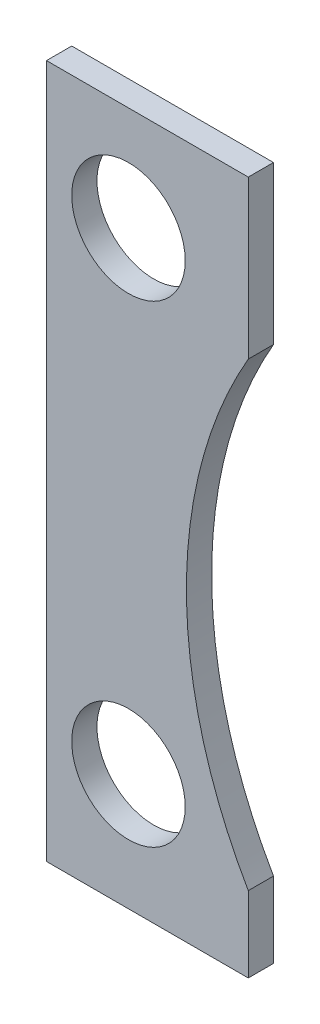
ISO-10303-21;
HEADER;
FILE_DESCRIPTION(('STEP AP214'),'2;1');
FILE_NAME('part.step','',(''),(''),'','','');
FILE_SCHEMA(('AUTOMOTIVE_DESIGN { 1 0 10303 214 1 1 1 1 }'));
ENDSEC;
DATA;
#1=APPLICATION_CONTEXT('core data for automotive mechanical design processes');
#2=APPLICATION_PROTOCOL_DEFINITION('international standard','automotive_design',2000,#1);
#3=PRODUCT_CONTEXT('',#1,'mechanical');
#4=PRODUCT('Part','Part','',(#3));
#5=PRODUCT_RELATED_PRODUCT_CATEGORY('part','',(#4));
#6=PRODUCT_DEFINITION_FORMATION('','',#4);
#7=PRODUCT_DEFINITION_CONTEXT('part definition',#1,'design');
#8=PRODUCT_DEFINITION('design','',#6,#7);
#9=PRODUCT_DEFINITION_SHAPE('','',#8);
#10=(LENGTH_UNIT() NAMED_UNIT(*) SI_UNIT(.MILLI.,.METRE.));
#11=(NAMED_UNIT(*) PLANE_ANGLE_UNIT() SI_UNIT($,.RADIAN.));
#12=(NAMED_UNIT(*) SI_UNIT($,.STERADIAN.) SOLID_ANGLE_UNIT());
#13=UNCERTAINTY_MEASURE_WITH_UNIT(LENGTH_MEASURE(1.E-05),#10,'distance_accuracy_value','');
#14=(GEOMETRIC_REPRESENTATION_CONTEXT(3) GLOBAL_UNCERTAINTY_ASSIGNED_CONTEXT((#13)) GLOBAL_UNIT_ASSIGNED_CONTEXT((#10,
#11,#12)) REPRESENTATION_CONTEXT('',''));
#15=CARTESIAN_POINT('',(0.,0.,0.));
#16=DIRECTION('',(0.,0.,1.));
#17=DIRECTION('',(1.,0.,0.));
#18=AXIS2_PLACEMENT_3D('',#15,#16,#17);
#19=CARTESIAN_POINT('',(0.,0.,2.));
#20=DIRECTION('',(0.,1.,0.));
#21=DIRECTION('',(0.,0.,1.));
#22=AXIS2_PLACEMENT_3D('',#19,#20,#21);
#23=PLANE('',#22);
#24=DIRECTION('',(1.,0.,0.));
#25=VECTOR('',#24,1.);
#26=CARTESIAN_POINT('',(0.,0.,-2.));
#27=LINE('',#26,#25);
#28=CARTESIAN_POINT('',(0.,0.,-2.));
#29=VERTEX_POINT('',#28);
#30=CARTESIAN_POINT('',(32.,0.,-2.));
#31=VERTEX_POINT('',#30);
#32=EDGE_CURVE('E118',#29,#31,#27,.T.);
#33=ORIENTED_EDGE('',*,*,#32,.T.);
#34=DIRECTION('',(0.,0.,-1.));
#35=VECTOR('',#34,1.);
#36=CARTESIAN_POINT('',(32.,0.,2.));
#37=LINE('',#36,#35);
#38=CARTESIAN_POINT('',(32.,0.,2.));
#39=VERTEX_POINT('',#38);
#40=EDGE_CURVE('E11',#39,#31,#37,.T.);
#41=ORIENTED_EDGE('',*,*,#40,.F.);
#42=DIRECTION('',(1.,0.,0.));
#43=VECTOR('',#42,1.);
#44=CARTESIAN_POINT('',(0.,0.,2.));
#45=LINE('',#44,#43);
#46=CARTESIAN_POINT('',(0.,0.,2.));
#47=VERTEX_POINT('',#46);
#48=EDGE_CURVE('E129',#47,#39,#45,.T.);
#49=ORIENTED_EDGE('',*,*,#48,.F.);
#50=DIRECTION('',(0.,0.,-1.));
#51=VECTOR('',#50,1.);
#52=CARTESIAN_POINT('',(0.,0.,2.));
#53=LINE('',#52,#51);
#54=EDGE_CURVE('E114',#47,#29,#53,.T.);
#55=ORIENTED_EDGE('',*,*,#54,.T.);
#56=EDGE_LOOP('',(#33,#41,#49,#55));
#57=FACE_BOUND('',#56,.T.);
#58=ADVANCED_FACE('F34',(#57),#23,.F.);
#59=CARTESIAN_POINT('',(32.,0.,2.));
#60=DIRECTION('',(-1.,0.,0.));
#61=DIRECTION('',(0.,-1.,0.));
#62=AXIS2_PLACEMENT_3D('',#59,#60,#61);
#63=PLANE('',#62);
#64=DIRECTION('',(0.,1.,0.));
#65=VECTOR('',#64,1.);
#66=CARTESIAN_POINT('',(32.,0.,-2.));
#67=LINE('',#66,#65);
#68=CARTESIAN_POINT('',(32.,12.,-2.));
#69=VERTEX_POINT('',#68);
#70=EDGE_CURVE('E121',#31,#69,#67,.T.);
#71=ORIENTED_EDGE('',*,*,#70,.T.);
#72=DIRECTION('',(0.,0.,-1.));
#73=VECTOR('',#72,1.);
#74=CARTESIAN_POINT('',(32.,12.,2.));
#75=LINE('',#74,#73);
#76=CARTESIAN_POINT('',(32.,12.,2.));
#77=VERTEX_POINT('',#76);
#78=EDGE_CURVE('E42',#77,#69,#75,.T.);
#79=ORIENTED_EDGE('',*,*,#78,.F.);
#80=DIRECTION('',(0.,1.,0.));
#81=VECTOR('',#80,1.);
#82=CARTESIAN_POINT('',(32.,0.,2.));
#83=LINE('',#82,#81);
#84=EDGE_CURVE('E87',#39,#77,#83,.T.);
#85=ORIENTED_EDGE('',*,*,#84,.F.);
#86=ORIENTED_EDGE('',*,*,#40,.T.);
#87=EDGE_LOOP('',(#71,#79,#85,#86));
#88=FACE_BOUND('',#87,.T.);
#89=ADVANCED_FACE('F154',(#88),#63,.F.);
#90=CARTESIAN_POINT('',(95.,48.5,2.));
#91=DIRECTION('',(0.,0.,-1.));
#92=DIRECTION('',(-1.,0.,0.));
#93=AXIS2_PLACEMENT_3D('',#90,#91,#92);
#94=CYLINDRICAL_SURFACE('',#93,72.8096834219185);
#95=CARTESIAN_POINT('',(95.,48.5,-2.));
#96=DIRECTION('',(0.,0.,-1.));
#97=DIRECTION('',(-1.,0.,0.));
#98=AXIS2_PLACEMENT_3D('',#95,#96,#97);
#99=CIRCLE('',#98,72.8096834219185);
#100=CARTESIAN_POINT('',(32.,85.,-2.));
#101=VERTEX_POINT('',#100);
#102=EDGE_CURVE('E124',#69,#101,#99,.T.);
#103=ORIENTED_EDGE('',*,*,#102,.T.);
#104=DIRECTION('',(0.,0.,-1.));
#105=VECTOR('',#104,1.);
#106=CARTESIAN_POINT('',(32.,85.,2.));
#107=LINE('',#106,#105);
#108=CARTESIAN_POINT('',(32.,85.,2.));
#109=VERTEX_POINT('',#108);
#110=EDGE_CURVE('E109',#109,#101,#107,.T.);
#111=ORIENTED_EDGE('',*,*,#110,.F.);
#112=CARTESIAN_POINT('',(95.,48.5,2.));
#113=DIRECTION('',(0.,0.,-1.));
#114=DIRECTION('',(-1.,0.,0.));
#115=AXIS2_PLACEMENT_3D('',#112,#113,#114);
#116=CIRCLE('',#115,72.8096834219185);
#117=EDGE_CURVE('E100',#77,#109,#116,.T.);
#118=ORIENTED_EDGE('',*,*,#117,.F.);
#119=ORIENTED_EDGE('',*,*,#78,.T.);
#120=EDGE_LOOP('',(#103,#111,#118,#119));
#121=FACE_BOUND('',#120,.T.);
#122=ADVANCED_FACE('F135',(#121),#94,.F.);
#123=CARTESIAN_POINT('',(32.,110.,2.));
#124=DIRECTION('',(-1.,0.,0.));
#125=DIRECTION('',(0.,-1.,0.));
#126=AXIS2_PLACEMENT_3D('',#123,#124,#125);
#127=PLANE('',#126);
#128=DIRECTION('',(0.,1.,0.));
#129=VECTOR('',#128,1.);
#130=CARTESIAN_POINT('',(32.,110.,-2.));
#131=LINE('',#130,#129);
#132=CARTESIAN_POINT('',(32.,110.,-2.));
#133=VERTEX_POINT('',#132);
#134=EDGE_CURVE('E108',#101,#133,#131,.T.);
#135=ORIENTED_EDGE('',*,*,#134,.T.);
#136=DIRECTION('',(0.,0.,-1.));
#137=VECTOR('',#136,1.);
#138=CARTESIAN_POINT('',(32.,110.,2.));
#139=LINE('',#138,#137);
#140=CARTESIAN_POINT('',(32.,110.,2.));
#141=VERTEX_POINT('',#140);
#142=EDGE_CURVE('E105',#141,#133,#139,.T.);
#143=ORIENTED_EDGE('',*,*,#142,.F.);
#144=DIRECTION('',(0.,1.,0.));
#145=VECTOR('',#144,1.);
#146=CARTESIAN_POINT('',(32.,110.,2.));
#147=LINE('',#146,#145);
#148=EDGE_CURVE('E94',#109,#141,#147,.T.);
#149=ORIENTED_EDGE('',*,*,#148,.F.);
#150=ORIENTED_EDGE('',*,*,#110,.T.);
#151=EDGE_LOOP('',(#135,#143,#149,#150));
#152=FACE_BOUND('',#151,.T.);
#153=ADVANCED_FACE('F106',(#152),#127,.F.);
#154=CARTESIAN_POINT('',(0.,110.,2.));
#155=DIRECTION('',(0.,-1.,0.));
#156=DIRECTION('',(0.,0.,-1.));
#157=AXIS2_PLACEMENT_3D('',#154,#155,#156);
#158=PLANE('',#157);
#159=DIRECTION('',(-1.,0.,0.));
#160=VECTOR('',#159,1.);
#161=CARTESIAN_POINT('',(0.,110.,-2.));
#162=LINE('',#161,#160);
#163=CARTESIAN_POINT('',(0.,110.,-2.));
#164=VERTEX_POINT('',#163);
#165=EDGE_CURVE('E73',#133,#164,#162,.T.);
#166=ORIENTED_EDGE('',*,*,#165,.T.);
#167=DIRECTION('',(0.,0.,-1.));
#168=VECTOR('',#167,1.);
#169=CARTESIAN_POINT('',(0.,110.,2.));
#170=LINE('',#169,#168);
#171=CARTESIAN_POINT('',(0.,110.,2.));
#172=VERTEX_POINT('',#171);
#173=EDGE_CURVE('E110',#172,#164,#170,.T.);
#174=ORIENTED_EDGE('',*,*,#173,.F.);
#175=DIRECTION('',(-1.,0.,0.));
#176=VECTOR('',#175,1.);
#177=CARTESIAN_POINT('',(0.,110.,2.));
#178=LINE('',#177,#176);
#179=EDGE_CURVE('E98',#141,#172,#178,.T.);
#180=ORIENTED_EDGE('',*,*,#179,.F.);
#181=ORIENTED_EDGE('',*,*,#142,.T.);
#182=EDGE_LOOP('',(#166,#174,#180,#181));
#183=FACE_BOUND('',#182,.T.);
#184=ADVANCED_FACE('F112',(#183),#158,.F.);
#185=CARTESIAN_POINT('',(0.,0.,2.));
#186=DIRECTION('',(1.,0.,0.));
#187=DIRECTION('',(0.,0.,-1.));
#188=AXIS2_PLACEMENT_3D('',#185,#186,#187);
#189=PLANE('',#188);
#190=DIRECTION('',(0.,-1.,0.));
#191=VECTOR('',#190,1.);
#192=CARTESIAN_POINT('',(0.,0.,-2.));
#193=LINE('',#192,#191);
#194=EDGE_CURVE('E79',#164,#29,#193,.T.);
#195=ORIENTED_EDGE('',*,*,#194,.T.);
#196=ORIENTED_EDGE('',*,*,#54,.F.);
#197=DIRECTION('',(0.,-1.,0.));
#198=VECTOR('',#197,1.);
#199=CARTESIAN_POINT('',(0.,0.,2.));
#200=LINE('',#199,#198);
#201=EDGE_CURVE('E50',#172,#47,#200,.T.);
#202=ORIENTED_EDGE('',*,*,#201,.F.);
#203=ORIENTED_EDGE('',*,*,#173,.T.);
#204=EDGE_LOOP('',(#195,#196,#202,#203));
#205=FACE_BOUND('',#204,.T.);
#206=ADVANCED_FACE('F142',(#205),#189,.F.);
#207=CARTESIAN_POINT('',(95.,48.5,2.));
#208=DIRECTION('',(0.,0.,-1.));
#209=DIRECTION('',(-1.,0.,0.));
#210=AXIS2_PLACEMENT_3D('',#207,#208,#209);
#211=PLANE('',#210);
#212=CARTESIAN_POINT('',(13.,93.5,2.));
#213=DIRECTION('',(0.,0.,1.));
#214=DIRECTION('',(1.,0.,0.));
#215=AXIS2_PLACEMENT_3D('',#212,#213,#214);
#216=CIRCLE('',#215,9.00000000000002);
#217=CARTESIAN_POINT('',(22.0000000000001,93.5,2.));
#218=VERTEX_POINT('',#217);
#219=EDGE_CURVE('E219',#218,#218,#216,.T.);
#220=ORIENTED_EDGE('',*,*,#219,.F.);
#221=EDGE_LOOP('',(#220));
#222=FACE_BOUND('',#221,.T.);
#223=CARTESIAN_POINT('',(13.0000000000001,18.5,2.));
#224=DIRECTION('',(0.,0.,1.));
#225=DIRECTION('',(1.,0.,0.));
#226=AXIS2_PLACEMENT_3D('',#223,#224,#225);
#227=CIRCLE('',#226,9.);
#228=CARTESIAN_POINT('',(22.0000000000001,18.5,2.));
#229=VERTEX_POINT('',#228);
#230=EDGE_CURVE('E224',#229,#229,#227,.T.);
#231=ORIENTED_EDGE('',*,*,#230,.F.);
#232=EDGE_LOOP('',(#231));
#233=FACE_BOUND('',#232,.T.);
#234=ORIENTED_EDGE('',*,*,#48,.T.);
#235=ORIENTED_EDGE('',*,*,#84,.T.);
#236=ORIENTED_EDGE('',*,*,#117,.T.);
#237=ORIENTED_EDGE('',*,*,#148,.T.);
#238=ORIENTED_EDGE('',*,*,#179,.T.);
#239=ORIENTED_EDGE('',*,*,#201,.T.);
#240=EDGE_LOOP('',(#234,#235,#236,#237,#238,#239));
#241=FACE_BOUND('',#240,.T.);
#242=ADVANCED_FACE('F96',(#222,#233,#241),#211,.F.);
#243=CARTESIAN_POINT('',(95.,48.5,-2.));
#244=DIRECTION('',(0.,0.,-1.));
#245=DIRECTION('',(-1.,0.,0.));
#246=AXIS2_PLACEMENT_3D('',#243,#244,#245);
#247=PLANE('',#246);
#248=CARTESIAN_POINT('',(13.,93.5,-2.));
#249=DIRECTION('',(0.,0.,1.));
#250=DIRECTION('',(1.,0.,0.));
#251=AXIS2_PLACEMENT_3D('',#248,#249,#250);
#252=CIRCLE('',#251,9.00000000000002);
#253=CARTESIAN_POINT('',(22.0000000000001,93.5,-2.));
#254=VERTEX_POINT('',#253);
#255=EDGE_CURVE('E122',#254,#254,#252,.T.);
#256=ORIENTED_EDGE('',*,*,#255,.T.);
#257=EDGE_LOOP('',(#256));
#258=FACE_BOUND('',#257,.T.);
#259=CARTESIAN_POINT('',(13.0000000000001,18.5,-2.));
#260=DIRECTION('',(0.,0.,1.));
#261=DIRECTION('',(1.,0.,0.));
#262=AXIS2_PLACEMENT_3D('',#259,#260,#261);
#263=CIRCLE('',#262,9.);
#264=CARTESIAN_POINT('',(22.0000000000001,18.5,-2.));
#265=VERTEX_POINT('',#264);
#266=EDGE_CURVE('E220',#265,#265,#263,.T.);
#267=ORIENTED_EDGE('',*,*,#266,.T.);
#268=EDGE_LOOP('',(#267));
#269=FACE_BOUND('',#268,.T.);
#270=ORIENTED_EDGE('',*,*,#32,.F.);
#271=ORIENTED_EDGE('',*,*,#194,.F.);
#272=ORIENTED_EDGE('',*,*,#165,.F.);
#273=ORIENTED_EDGE('',*,*,#134,.F.);
#274=ORIENTED_EDGE('',*,*,#102,.F.);
#275=ORIENTED_EDGE('',*,*,#70,.F.);
#276=EDGE_LOOP('',(#270,#271,#272,#273,#274,#275));
#277=FACE_BOUND('',#276,.T.);
#278=ADVANCED_FACE('F138',(#258,#269,#277),#247,.T.);
#279=CARTESIAN_POINT('',(13.0000000000001,18.5,-2.));
#280=DIRECTION('',(0.,0.,1.));
#281=DIRECTION('',(1.,0.,0.));
#282=AXIS2_PLACEMENT_3D('',#279,#280,#281);
#283=CYLINDRICAL_SURFACE('',#282,9.);
#284=ORIENTED_EDGE('',*,*,#266,.F.);
#285=EDGE_LOOP('',(#284));
#286=FACE_BOUND('',#285,.T.);
#287=ORIENTED_EDGE('',*,*,#230,.T.);
#288=EDGE_LOOP('',(#287));
#289=FACE_BOUND('',#288,.T.);
#290=ADVANCED_FACE('F191',(#286,#289),#283,.F.);
#291=CARTESIAN_POINT('',(13.,93.5,-2.));
#292=DIRECTION('',(0.,0.,1.));
#293=DIRECTION('',(1.,0.,0.));
#294=AXIS2_PLACEMENT_3D('',#291,#292,#293);
#295=CYLINDRICAL_SURFACE('',#294,9.00000000000002);
#296=ORIENTED_EDGE('',*,*,#255,.F.);
#297=EDGE_LOOP('',(#296));
#298=FACE_BOUND('',#297,.T.);
#299=ORIENTED_EDGE('',*,*,#219,.T.);
#300=EDGE_LOOP('',(#299));
#301=FACE_BOUND('',#300,.T.);
#302=ADVANCED_FACE('F200',(#298,#301),#295,.F.);
#303=CLOSED_SHELL('',(#58,#89,#122,#153,#184,#206,#242,#278,#290,#302));
#304=MANIFOLD_SOLID_BREP('B2',#303);
#305=ADVANCED_BREP_SHAPE_REPRESENTATION('',(#18,#304),#14);
#306=SHAPE_DEFINITION_REPRESENTATION(#9,#305);
ENDSEC;
END-ISO-10303-21;
